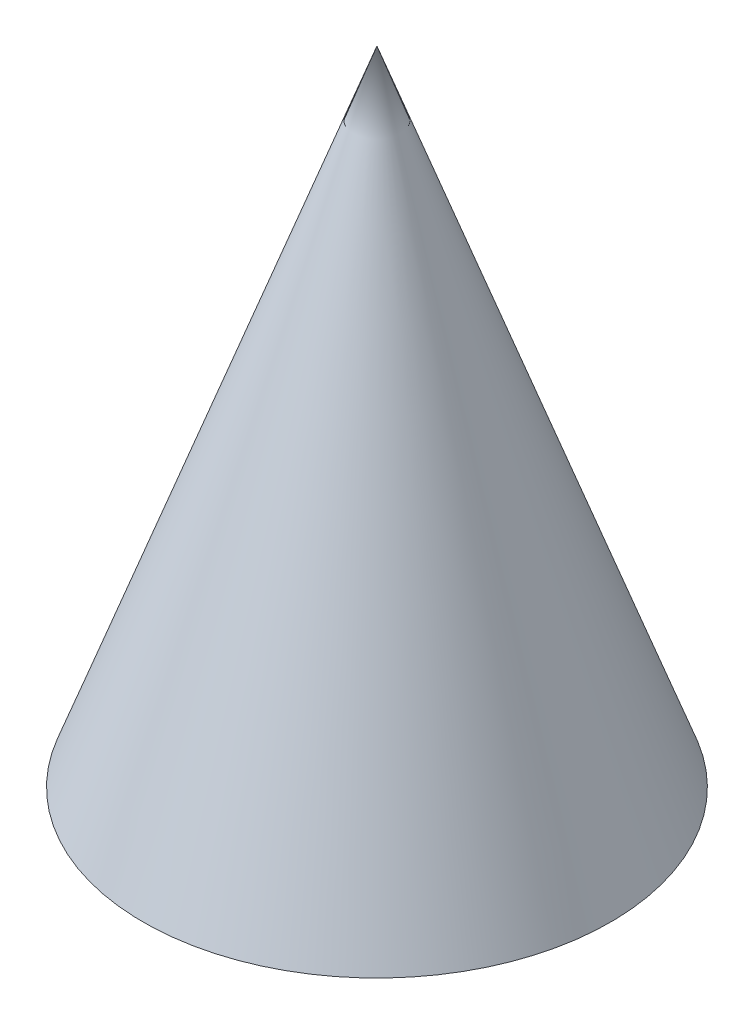
ISO-10303-21;
HEADER;
FILE_DESCRIPTION(('STEP AP214'),'2;1');
FILE_NAME('part.step','',(''),(''),'','','');
FILE_SCHEMA(('AUTOMOTIVE_DESIGN { 1 0 10303 214 1 1 1 1 }'));
ENDSEC;
DATA;
#1=APPLICATION_CONTEXT('core data for automotive mechanical design processes');
#2=APPLICATION_PROTOCOL_DEFINITION('international standard','automotive_design',2000,#1);
#3=PRODUCT_CONTEXT('',#1,'mechanical');
#4=PRODUCT('Part','Part','',(#3));
#5=PRODUCT_RELATED_PRODUCT_CATEGORY('part','',(#4));
#6=PRODUCT_DEFINITION_FORMATION('','',#4);
#7=PRODUCT_DEFINITION_CONTEXT('part definition',#1,'design');
#8=PRODUCT_DEFINITION('design','',#6,#7);
#9=PRODUCT_DEFINITION_SHAPE('','',#8);
#10=(LENGTH_UNIT() NAMED_UNIT(*) SI_UNIT(.MILLI.,.METRE.));
#11=(NAMED_UNIT(*) PLANE_ANGLE_UNIT() SI_UNIT($,.RADIAN.));
#12=(NAMED_UNIT(*) SI_UNIT($,.STERADIAN.) SOLID_ANGLE_UNIT());
#13=UNCERTAINTY_MEASURE_WITH_UNIT(LENGTH_MEASURE(1.E-05),#10,'distance_accuracy_value','');
#14=(GEOMETRIC_REPRESENTATION_CONTEXT(3) GLOBAL_UNCERTAINTY_ASSIGNED_CONTEXT((#13)) GLOBAL_UNIT_ASSIGNED_CONTEXT((#10,
#11,#12)) REPRESENTATION_CONTEXT('',''));
#15=CARTESIAN_POINT('',(0.,0.,0.));
#16=DIRECTION('',(0.,0.,1.));
#17=DIRECTION('',(1.,0.,0.));
#18=AXIS2_PLACEMENT_3D('',#15,#16,#17);
#19=CARTESIAN_POINT('',(0.,-10.,0.));
#20=DIRECTION('',(0.,-1.,0.));
#21=DIRECTION('',(0.866025403784443,0.,0.499999999999992));
#22=AXIS2_PLACEMENT_3D('',#19,#20,#21);
#23=PLANE('',#22);
#24=CARTESIAN_POINT('',(0.,-10.,0.));
#25=DIRECTION('',(0.,-1.,0.));
#26=DIRECTION('',(0.,0.,-1.));
#27=AXIS2_PLACEMENT_3D('',#24,#25,#26);
#28=CIRCLE('',#27,20.);
#29=CARTESIAN_POINT('',(-17.3205080756887,-10.,10.0000000000001));
#30=VERTEX_POINT('',#29);
#31=CARTESIAN_POINT('',(0.,-10.,-20.));
#32=VERTEX_POINT('',#31);
#33=EDGE_CURVE('E48',#30,#32,#28,.T.);
#34=ORIENTED_EDGE('',*,*,#33,.T.);
#35=CARTESIAN_POINT('',(0.,-10.,0.));
#36=DIRECTION('',(0.,-1.,0.));
#37=DIRECTION('',(0.,0.,-1.));
#38=AXIS2_PLACEMENT_3D('',#35,#36,#37);
#39=CIRCLE('',#38,20.);
#40=CARTESIAN_POINT('',(17.3205080756889,-10.,9.99999999999984));
#41=VERTEX_POINT('',#40);
#42=EDGE_CURVE('E11',#32,#41,#39,.T.);
#43=ORIENTED_EDGE('',*,*,#42,.T.);
#44=CARTESIAN_POINT('',(0.,-10.,0.));
#45=DIRECTION('',(0.,-1.,0.));
#46=DIRECTION('',(0.,0.,-1.));
#47=AXIS2_PLACEMENT_3D('',#44,#45,#46);
#48=CIRCLE('',#47,20.);
#49=EDGE_CURVE('E75',#41,#30,#48,.T.);
#50=ORIENTED_EDGE('',*,*,#49,.T.);
#51=EDGE_LOOP('',(#34,#43,#50));
#52=FACE_BOUND('',#51,.T.);
#53=ADVANCED_FACE('F39',(#52),#23,.T.);
#54=CARTESIAN_POINT('',(0.,-10.,0.));
#55=DIRECTION('',(0.,-1.,0.));
#56=DIRECTION('',(0.,0.,-1.));
#57=AXIS2_PLACEMENT_3D('',#54,#55,#56);
#58=CONICAL_SURFACE('',#57,20.,0.349065850398867);
#59=DIRECTION('',(0.296198132726026,-0.939692620785908,0.171010071662832));
#60=VECTOR('',#59,1.);
#61=CARTESIAN_POINT('',(17.3205080756889,-10.,9.99999999999984));
#62=LINE('',#61,#60);
#63=CARTESIAN_POINT('',(4.71220931185258,30.,2.72059531467589));
#64=VERTEX_POINT('',#63);
#65=EDGE_CURVE('E78',#64,#41,#62,.T.);
#66=ORIENTED_EDGE('',*,*,#65,.F.);
#67=ORIENTED_EDGE('',*,*,#65,.T.);
#68=ORIENTED_EDGE('',*,*,#42,.F.);
#69=DIRECTION('',(0.,-0.939692620785908,-0.342020143325669));
#70=VECTOR('',#69,1.);
#71=CARTESIAN_POINT('',(0.,-10.,-20.));
#72=LINE('',#71,#70);
#73=CARTESIAN_POINT('',(0.,30.,-5.44119062935187));
#74=VERTEX_POINT('',#73);
#75=EDGE_CURVE('E59',#32,#74,#72,.F.);
#76=ORIENTED_EDGE('',*,*,#75,.T.);
#77=ORIENTED_EDGE('',*,*,#75,.F.);
#78=ORIENTED_EDGE('',*,*,#33,.F.);
#79=DIRECTION('',(-0.296198132726024,-0.939692620785908,0.171010071662836));
#80=VECTOR('',#79,1.);
#81=CARTESIAN_POINT('',(-17.3205080756887,-10.,10.0000000000001));
#82=LINE('',#81,#80);
#83=CARTESIAN_POINT('',(-4.71220931185255,30.,2.72059531467596));
#84=VERTEX_POINT('',#83);
#85=EDGE_CURVE('E43',#30,#84,#82,.F.);
#86=ORIENTED_EDGE('',*,*,#85,.T.);
#87=ORIENTED_EDGE('',*,*,#85,.F.);
#88=ORIENTED_EDGE('',*,*,#49,.F.);
#89=EDGE_LOOP('',(#66,#67,#68,#76,#77,#78,#86,#87,#88));
#90=FACE_BOUND('',#89,.T.);
#91=CARTESIAN_POINT('',(0.,44.9495483890923,0.));
#92=VERTEX_POINT('',#91);
#93=VERTEX_LOOP('',#92);
#94=FACE_BOUND('',#93,.T.);
#95=ADVANCED_FACE('F41',(#90,#94),#58,.T.);
#96=CLOSED_SHELL('',(#53,#95));
#97=MANIFOLD_SOLID_BREP('B2',#96);
#98=ADVANCED_BREP_SHAPE_REPRESENTATION('',(#18,#97),#14);
#99=SHAPE_DEFINITION_REPRESENTATION(#9,#98);
ENDSEC;
END-ISO-10303-21;
